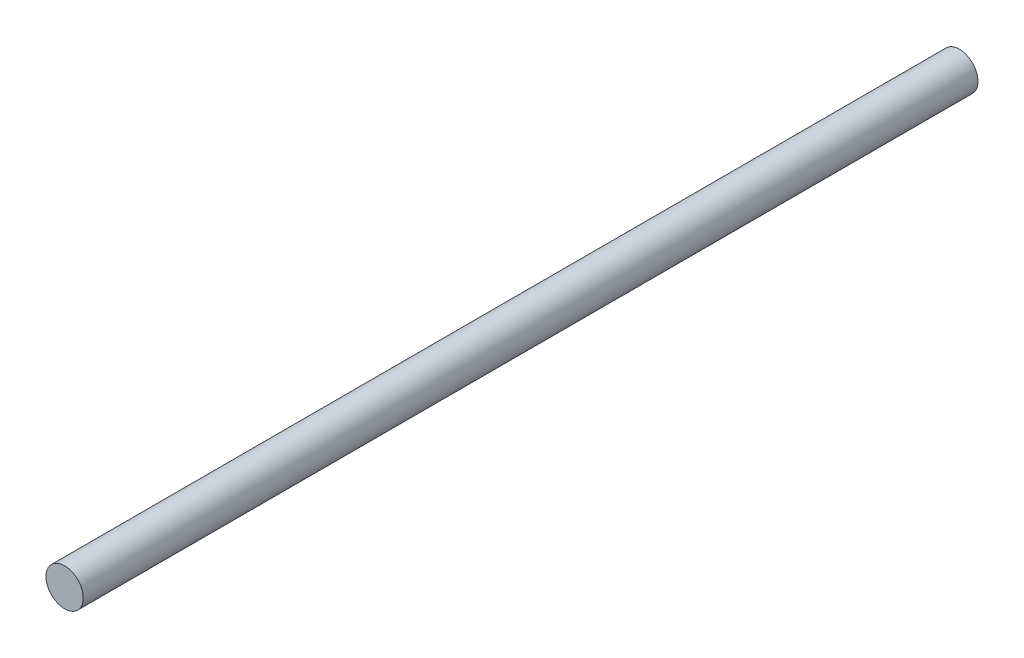
ISO-10303-21;
HEADER;
FILE_DESCRIPTION(('STEP AP214'),'2;1');
FILE_NAME('part.step','',(''),(''),'','','');
FILE_SCHEMA(('AUTOMOTIVE_DESIGN { 1 0 10303 214 1 1 1 1 }'));
ENDSEC;
DATA;
#1=APPLICATION_CONTEXT('core data for automotive mechanical design processes');
#2=APPLICATION_PROTOCOL_DEFINITION('international standard','automotive_design',2000,#1);
#3=PRODUCT_CONTEXT('',#1,'mechanical');
#4=PRODUCT('Part','Part','',(#3));
#5=PRODUCT_RELATED_PRODUCT_CATEGORY('part','',(#4));
#6=PRODUCT_DEFINITION_FORMATION('','',#4);
#7=PRODUCT_DEFINITION_CONTEXT('part definition',#1,'design');
#8=PRODUCT_DEFINITION('design','',#6,#7);
#9=PRODUCT_DEFINITION_SHAPE('','',#8);
#10=(LENGTH_UNIT() NAMED_UNIT(*) SI_UNIT(.MILLI.,.METRE.));
#11=(NAMED_UNIT(*) PLANE_ANGLE_UNIT() SI_UNIT($,.RADIAN.));
#12=(NAMED_UNIT(*) SI_UNIT($,.STERADIAN.) SOLID_ANGLE_UNIT());
#13=UNCERTAINTY_MEASURE_WITH_UNIT(LENGTH_MEASURE(1.E-05),#10,'distance_accuracy_value','');
#14=(GEOMETRIC_REPRESENTATION_CONTEXT(3) GLOBAL_UNCERTAINTY_ASSIGNED_CONTEXT((#13)) GLOBAL_UNIT_ASSIGNED_CONTEXT((#10,
#11,#12)) REPRESENTATION_CONTEXT('',''));
#15=CARTESIAN_POINT('',(0.,0.,0.));
#16=DIRECTION('',(0.,0.,1.));
#17=DIRECTION('',(1.,0.,0.));
#18=AXIS2_PLACEMENT_3D('',#15,#16,#17);
#19=CARTESIAN_POINT('',(0.,0.,76.2));
#20=DIRECTION('',(0.,0.,-1.));
#21=DIRECTION('',(-1.,0.,0.));
#22=AXIS2_PLACEMENT_3D('',#19,#20,#21);
#23=CYLINDRICAL_SURFACE('',#22,1.5875);
#24=CARTESIAN_POINT('',(0.,0.,76.2));
#25=DIRECTION('',(0.,0.,1.));
#26=DIRECTION('',(1.,0.,0.));
#27=AXIS2_PLACEMENT_3D('',#24,#25,#26);
#28=CIRCLE('',#27,1.5875);
#29=CARTESIAN_POINT('',(1.5875,0.,76.2));
#30=VERTEX_POINT('',#29);
#31=EDGE_CURVE('E10',#30,#30,#28,.T.);
#32=ORIENTED_EDGE('',*,*,#31,.F.);
#33=EDGE_LOOP('',(#32));
#34=FACE_BOUND('',#33,.T.);
#35=CARTESIAN_POINT('',(0.,0.,0.));
#36=DIRECTION('',(0.,0.,1.));
#37=DIRECTION('',(1.,0.,0.));
#38=AXIS2_PLACEMENT_3D('',#35,#36,#37);
#39=CIRCLE('',#38,1.5875);
#40=CARTESIAN_POINT('',(1.5875,0.,0.));
#41=VERTEX_POINT('',#40);
#42=EDGE_CURVE('E44',#41,#41,#39,.T.);
#43=ORIENTED_EDGE('',*,*,#42,.T.);
#44=EDGE_LOOP('',(#43));
#45=FACE_BOUND('',#44,.T.);
#46=ADVANCED_FACE('F41',(#34,#45),#23,.T.);
#47=CARTESIAN_POINT('',(0.,0.,76.2));
#48=DIRECTION('',(0.,0.,1.));
#49=DIRECTION('',(1.,0.,0.));
#50=AXIS2_PLACEMENT_3D('',#47,#48,#49);
#51=PLANE('',#50);
#52=ORIENTED_EDGE('',*,*,#31,.T.);
#53=EDGE_LOOP('',(#52));
#54=FACE_BOUND('',#53,.T.);
#55=ADVANCED_FACE('F58',(#54),#51,.T.);
#56=CARTESIAN_POINT('',(0.,0.,0.));
#57=DIRECTION('',(0.,0.,1.));
#58=DIRECTION('',(1.,0.,0.));
#59=AXIS2_PLACEMENT_3D('',#56,#57,#58);
#60=PLANE('',#59);
#61=ORIENTED_EDGE('',*,*,#42,.F.);
#62=EDGE_LOOP('',(#61));
#63=FACE_BOUND('',#62,.T.);
#64=ADVANCED_FACE('F56',(#63),#60,.F.);
#65=CLOSED_SHELL('',(#46,#55,#64));
#66=MANIFOLD_SOLID_BREP('B2',#65);
#67=ADVANCED_BREP_SHAPE_REPRESENTATION('',(#18,#66),#14);
#68=SHAPE_DEFINITION_REPRESENTATION(#9,#67);
ENDSEC;
END-ISO-10303-21;
